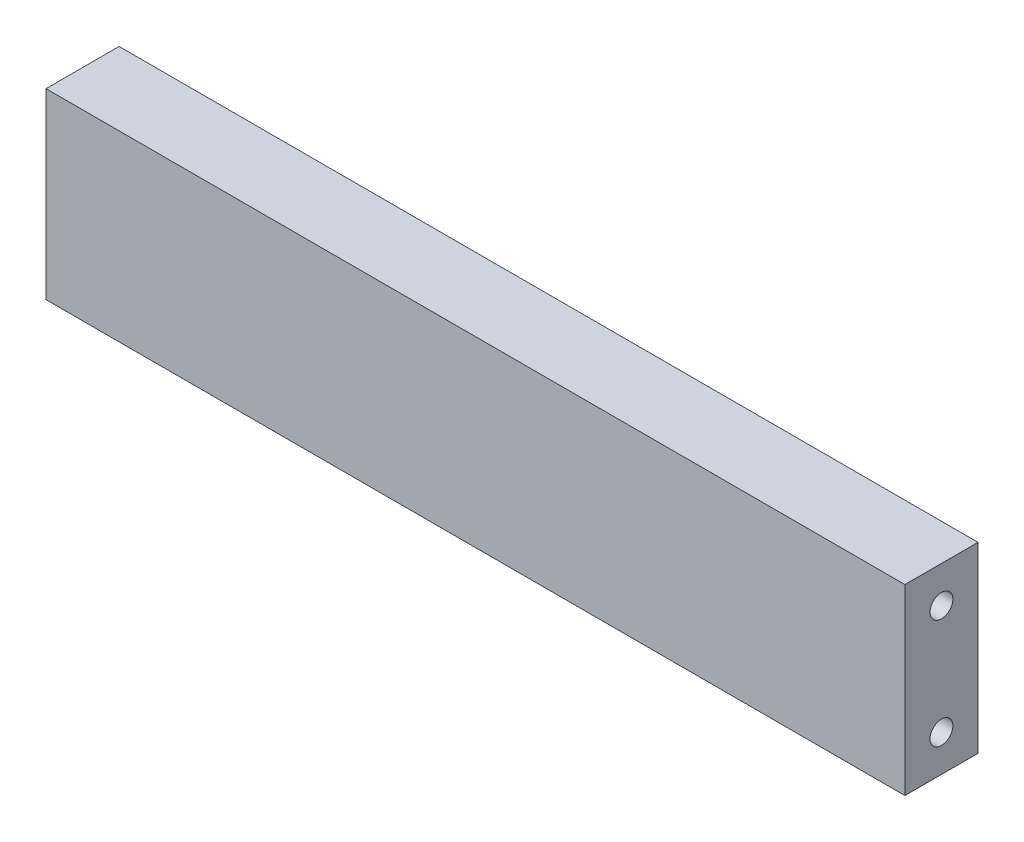
ISO-10303-21;
HEADER;
FILE_DESCRIPTION(('STEP AP214'),'2;1');
FILE_NAME('part.step','',(''),(''),'','','');
FILE_SCHEMA(('AUTOMOTIVE_DESIGN { 1 0 10303 214 1 1 1 1 }'));
ENDSEC;
DATA;
#1=APPLICATION_CONTEXT('core data for automotive mechanical design processes');
#2=APPLICATION_PROTOCOL_DEFINITION('international standard','automotive_design',2000,#1);
#3=PRODUCT_CONTEXT('',#1,'mechanical');
#4=PRODUCT('Part','Part','',(#3));
#5=PRODUCT_RELATED_PRODUCT_CATEGORY('part','',(#4));
#6=PRODUCT_DEFINITION_FORMATION('','',#4);
#7=PRODUCT_DEFINITION_CONTEXT('part definition',#1,'design');
#8=PRODUCT_DEFINITION('design','',#6,#7);
#9=PRODUCT_DEFINITION_SHAPE('','',#8);
#10=(LENGTH_UNIT() NAMED_UNIT(*) SI_UNIT(.MILLI.,.METRE.));
#11=(NAMED_UNIT(*) PLANE_ANGLE_UNIT() SI_UNIT($,.RADIAN.));
#12=(NAMED_UNIT(*) SI_UNIT($,.STERADIAN.) SOLID_ANGLE_UNIT());
#13=UNCERTAINTY_MEASURE_WITH_UNIT(LENGTH_MEASURE(1.E-05),#10,'distance_accuracy_value','');
#14=(GEOMETRIC_REPRESENTATION_CONTEXT(3) GLOBAL_UNCERTAINTY_ASSIGNED_CONTEXT((#13)) GLOBAL_UNIT_ASSIGNED_CONTEXT((#10,
#11,#12)) REPRESENTATION_CONTEXT('',''));
#15=CARTESIAN_POINT('',(0.,0.,0.));
#16=DIRECTION('',(0.,0.,1.));
#17=DIRECTION('',(1.,0.,0.));
#18=AXIS2_PLACEMENT_3D('',#15,#16,#17);
#19=CARTESIAN_POINT('',(47.,10.,8.));
#20=DIRECTION('',(-1.,0.,0.));
#21=DIRECTION('',(0.,0.,1.));
#22=AXIS2_PLACEMENT_3D('',#19,#20,#21);
#23=PLANE('',#22);
#24=CARTESIAN_POINT('',(47.,6.,4.));
#25=DIRECTION('',(1.,0.,0.));
#26=DIRECTION('',(0.,0.,-1.));
#27=AXIS2_PLACEMENT_3D('',#24,#25,#26);
#28=CIRCLE('',#27,1.24999999999999);
#29=CARTESIAN_POINT('',(47.,6.,2.75000000000001));
#30=VERTEX_POINT('',#29);
#31=EDGE_CURVE('E119',#30,#30,#28,.T.);
#32=ORIENTED_EDGE('',*,*,#31,.F.);
#33=EDGE_LOOP('',(#32));
#34=FACE_BOUND('',#33,.T.);
#35=CARTESIAN_POINT('',(47.,-6.,4.));
#36=DIRECTION('',(1.,0.,0.));
#37=DIRECTION('',(0.,0.,-1.));
#38=AXIS2_PLACEMENT_3D('',#35,#36,#37);
#39=CIRCLE('',#38,1.24999999999999);
#40=CARTESIAN_POINT('',(47.,-6.,2.75000000000001));
#41=VERTEX_POINT('',#40);
#42=EDGE_CURVE('E125',#41,#41,#39,.T.);
#43=ORIENTED_EDGE('',*,*,#42,.F.);
#44=EDGE_LOOP('',(#43));
#45=FACE_BOUND('',#44,.T.);
#46=DIRECTION('',(0.,1.,0.));
#47=VECTOR('',#46,1.);
#48=CARTESIAN_POINT('',(47.,10.,0.));
#49=LINE('',#48,#47);
#50=CARTESIAN_POINT('',(47.,-10.,0.));
#51=VERTEX_POINT('',#50);
#52=CARTESIAN_POINT('',(47.,10.,0.));
#53=VERTEX_POINT('',#52);
#54=EDGE_CURVE('E131',#51,#53,#49,.T.);
#55=ORIENTED_EDGE('',*,*,#54,.T.);
#56=DIRECTION('',(0.,0.,-1.));
#57=VECTOR('',#56,1.);
#58=CARTESIAN_POINT('',(47.,10.,8.));
#59=LINE('',#58,#57);
#60=CARTESIAN_POINT('',(47.,10.,8.));
#61=VERTEX_POINT('',#60);
#62=EDGE_CURVE('E11',#61,#53,#59,.T.);
#63=ORIENTED_EDGE('',*,*,#62,.F.);
#64=DIRECTION('',(0.,1.,0.));
#65=VECTOR('',#64,1.);
#66=CARTESIAN_POINT('',(47.,10.,8.));
#67=LINE('',#66,#65);
#68=CARTESIAN_POINT('',(47.,-10.,8.));
#69=VERTEX_POINT('',#68);
#70=EDGE_CURVE('E132',#69,#61,#67,.T.);
#71=ORIENTED_EDGE('',*,*,#70,.F.);
#72=DIRECTION('',(0.,0.,-1.));
#73=VECTOR('',#72,1.);
#74=CARTESIAN_POINT('',(47.,-10.,8.));
#75=LINE('',#74,#73);
#76=EDGE_CURVE('E138',#69,#51,#75,.T.);
#77=ORIENTED_EDGE('',*,*,#76,.T.);
#78=EDGE_LOOP('',(#55,#63,#71,#77));
#79=FACE_BOUND('',#78,.T.);
#80=ADVANCED_FACE('F38',(#34,#45,#79),#23,.F.);
#81=CARTESIAN_POINT('',(-47.,10.,8.));
#82=DIRECTION('',(0.,-1.,0.));
#83=DIRECTION('',(0.,0.,-1.));
#84=AXIS2_PLACEMENT_3D('',#81,#82,#83);
#85=PLANE('',#84);
#86=DIRECTION('',(-1.,0.,0.));
#87=VECTOR('',#86,1.);
#88=CARTESIAN_POINT('',(-47.,10.,0.));
#89=LINE('',#88,#87);
#90=CARTESIAN_POINT('',(-47.,10.,0.));
#91=VERTEX_POINT('',#90);
#92=EDGE_CURVE('E141',#53,#91,#89,.T.);
#93=ORIENTED_EDGE('',*,*,#92,.T.);
#94=DIRECTION('',(0.,0.,-1.));
#95=VECTOR('',#94,1.);
#96=CARTESIAN_POINT('',(-47.,10.,8.));
#97=LINE('',#96,#95);
#98=CARTESIAN_POINT('',(-47.,10.,8.));
#99=VERTEX_POINT('',#98);
#100=EDGE_CURVE('E46',#99,#91,#97,.T.);
#101=ORIENTED_EDGE('',*,*,#100,.F.);
#102=DIRECTION('',(-1.,0.,0.));
#103=VECTOR('',#102,1.);
#104=CARTESIAN_POINT('',(-47.,10.,8.));
#105=LINE('',#104,#103);
#106=EDGE_CURVE('E85',#61,#99,#105,.T.);
#107=ORIENTED_EDGE('',*,*,#106,.F.);
#108=ORIENTED_EDGE('',*,*,#62,.T.);
#109=EDGE_LOOP('',(#93,#101,#107,#108));
#110=FACE_BOUND('',#109,.T.);
#111=ADVANCED_FACE('F164',(#110),#85,.F.);
#112=CARTESIAN_POINT('',(-47.,10.,8.));
#113=DIRECTION('',(1.,0.,0.));
#114=DIRECTION('',(0.,1.,0.));
#115=AXIS2_PLACEMENT_3D('',#112,#113,#114);
#116=PLANE('',#115);
#117=CARTESIAN_POINT('',(-47.,5.99999999999999,4.));
#118=DIRECTION('',(-1.,0.,0.));
#119=DIRECTION('',(0.,0.,1.));
#120=AXIS2_PLACEMENT_3D('',#117,#118,#119);
#121=CIRCLE('',#120,1.24999999999999);
#122=CARTESIAN_POINT('',(-47.,5.99999999999999,5.24999999999999));
#123=VERTEX_POINT('',#122);
#124=EDGE_CURVE('E109',#123,#123,#121,.T.);
#125=ORIENTED_EDGE('',*,*,#124,.F.);
#126=EDGE_LOOP('',(#125));
#127=FACE_BOUND('',#126,.T.);
#128=CARTESIAN_POINT('',(-47.,-6.00000000000002,4.));
#129=DIRECTION('',(-1.,0.,0.));
#130=DIRECTION('',(0.,0.,1.));
#131=AXIS2_PLACEMENT_3D('',#128,#129,#130);
#132=CIRCLE('',#131,1.24999999999999);
#133=CARTESIAN_POINT('',(-47.,-6.00000000000002,5.24999999999999));
#134=VERTEX_POINT('',#133);
#135=EDGE_CURVE('E108',#134,#134,#132,.T.);
#136=ORIENTED_EDGE('',*,*,#135,.F.);
#137=EDGE_LOOP('',(#136));
#138=FACE_BOUND('',#137,.T.);
#139=DIRECTION('',(0.,-1.,0.));
#140=VECTOR('',#139,1.);
#141=CARTESIAN_POINT('',(-47.,10.,0.));
#142=LINE('',#141,#140);
#143=CARTESIAN_POINT('',(-47.,-10.,0.));
#144=VERTEX_POINT('',#143);
#145=EDGE_CURVE('E72',#91,#144,#142,.T.);
#146=ORIENTED_EDGE('',*,*,#145,.T.);
#147=DIRECTION('',(0.,0.,-1.));
#148=VECTOR('',#147,1.);
#149=CARTESIAN_POINT('',(-47.,-10.,8.));
#150=LINE('',#149,#148);
#151=CARTESIAN_POINT('',(-47.,-10.,8.));
#152=VERTEX_POINT('',#151);
#153=EDGE_CURVE('E146',#152,#144,#150,.T.);
#154=ORIENTED_EDGE('',*,*,#153,.F.);
#155=DIRECTION('',(0.,-1.,0.));
#156=VECTOR('',#155,1.);
#157=CARTESIAN_POINT('',(-47.,10.,8.));
#158=LINE('',#157,#156);
#159=EDGE_CURVE('E135',#99,#152,#158,.T.);
#160=ORIENTED_EDGE('',*,*,#159,.F.);
#161=ORIENTED_EDGE('',*,*,#100,.T.);
#162=EDGE_LOOP('',(#146,#154,#160,#161));
#163=FACE_BOUND('',#162,.T.);
#164=ADVANCED_FACE('F148',(#127,#138,#163),#116,.F.);
#165=CARTESIAN_POINT('',(-47.,-10.,8.));
#166=DIRECTION('',(0.,1.,0.));
#167=DIRECTION('',(0.,0.,1.));
#168=AXIS2_PLACEMENT_3D('',#165,#166,#167);
#169=PLANE('',#168);
#170=DIRECTION('',(1.,0.,0.));
#171=VECTOR('',#170,1.);
#172=CARTESIAN_POINT('',(-47.,-10.,0.));
#173=LINE('',#172,#171);
#174=EDGE_CURVE('E78',#144,#51,#173,.T.);
#175=ORIENTED_EDGE('',*,*,#174,.T.);
#176=ORIENTED_EDGE('',*,*,#76,.F.);
#177=DIRECTION('',(1.,0.,0.));
#178=VECTOR('',#177,1.);
#179=CARTESIAN_POINT('',(-47.,-10.,8.));
#180=LINE('',#179,#178);
#181=EDGE_CURVE('E54',#152,#69,#180,.T.);
#182=ORIENTED_EDGE('',*,*,#181,.F.);
#183=ORIENTED_EDGE('',*,*,#153,.T.);
#184=EDGE_LOOP('',(#175,#176,#182,#183));
#185=FACE_BOUND('',#184,.T.);
#186=ADVANCED_FACE('F155',(#185),#169,.F.);
#187=CARTESIAN_POINT('',(0.,0.,8.));
#188=DIRECTION('',(0.,0.,1.));
#189=DIRECTION('',(1.,0.,0.));
#190=AXIS2_PLACEMENT_3D('',#187,#188,#189);
#191=PLANE('',#190);
#192=ORIENTED_EDGE('',*,*,#70,.T.);
#193=ORIENTED_EDGE('',*,*,#106,.T.);
#194=ORIENTED_EDGE('',*,*,#159,.T.);
#195=ORIENTED_EDGE('',*,*,#181,.T.);
#196=EDGE_LOOP('',(#192,#193,#194,#195));
#197=FACE_BOUND('',#196,.T.);
#198=ADVANCED_FACE('F157',(#197),#191,.T.);
#199=CARTESIAN_POINT('',(0.,0.,0.));
#200=DIRECTION('',(0.,0.,1.));
#201=DIRECTION('',(1.,0.,0.));
#202=AXIS2_PLACEMENT_3D('',#199,#200,#201);
#203=PLANE('',#202);
#204=ORIENTED_EDGE('',*,*,#54,.F.);
#205=ORIENTED_EDGE('',*,*,#174,.F.);
#206=ORIENTED_EDGE('',*,*,#145,.F.);
#207=ORIENTED_EDGE('',*,*,#92,.F.);
#208=EDGE_LOOP('',(#204,#205,#206,#207));
#209=FACE_BOUND('',#208,.T.);
#210=ADVANCED_FACE('F151',(#209),#203,.F.);
#211=CARTESIAN_POINT('',(38.5,-6.,4.));
#212=DIRECTION('',(1.,0.,0.));
#213=DIRECTION('',(0.,0.,-1.));
#214=AXIS2_PLACEMENT_3D('',#211,#212,#213);
#215=CONICAL_SURFACE('',#214,1.25,1.02974425867665);
#216=CARTESIAN_POINT('',(37.7489242262156,-6.,4.));
#217=VERTEX_POINT('',#216);
#218=VERTEX_LOOP('',#217);
#219=FACE_BOUND('',#218,.T.);
#220=CARTESIAN_POINT('',(38.5,-6.,4.));
#221=DIRECTION('',(1.,0.,0.));
#222=DIRECTION('',(0.,0.,-1.));
#223=AXIS2_PLACEMENT_3D('',#220,#221,#222);
#224=CIRCLE('',#223,1.25);
#225=CARTESIAN_POINT('',(38.5,-6.,2.75));
#226=VERTEX_POINT('',#225);
#227=EDGE_CURVE('E128',#226,#226,#224,.T.);
#228=ORIENTED_EDGE('',*,*,#227,.T.);
#229=EDGE_LOOP('',(#228));
#230=FACE_BOUND('',#229,.T.);
#231=ADVANCED_FACE('F180',(#219,#230),#215,.F.);
#232=CARTESIAN_POINT('',(47.,-6.,4.));
#233=DIRECTION('',(1.,0.,0.));
#234=DIRECTION('',(0.,0.,-1.));
#235=AXIS2_PLACEMENT_3D('',#232,#233,#234);
#236=CYLINDRICAL_SURFACE('',#235,1.24999999999999);
#237=ORIENTED_EDGE('',*,*,#227,.F.);
#238=EDGE_LOOP('',(#237));
#239=FACE_BOUND('',#238,.T.);
#240=ORIENTED_EDGE('',*,*,#42,.T.);
#241=EDGE_LOOP('',(#240));
#242=FACE_BOUND('',#241,.T.);
#243=ADVANCED_FACE('F177',(#239,#242),#236,.F.);
#244=CARTESIAN_POINT('',(38.5,6.,4.));
#245=DIRECTION('',(1.,0.,0.));
#246=DIRECTION('',(0.,0.,-1.));
#247=AXIS2_PLACEMENT_3D('',#244,#245,#246);
#248=CONICAL_SURFACE('',#247,1.25,1.02974425867665);
#249=CARTESIAN_POINT('',(37.7489242262156,6.,4.));
#250=VERTEX_POINT('',#249);
#251=VERTEX_LOOP('',#250);
#252=FACE_BOUND('',#251,.T.);
#253=CARTESIAN_POINT('',(38.5,6.,4.));
#254=DIRECTION('',(1.,0.,0.));
#255=DIRECTION('',(0.,0.,-1.));
#256=AXIS2_PLACEMENT_3D('',#253,#254,#255);
#257=CIRCLE('',#256,1.25);
#258=CARTESIAN_POINT('',(38.5,6.,2.75));
#259=VERTEX_POINT('',#258);
#260=EDGE_CURVE('E122',#259,#259,#257,.T.);
#261=ORIENTED_EDGE('',*,*,#260,.T.);
#262=EDGE_LOOP('',(#261));
#263=FACE_BOUND('',#262,.T.);
#264=ADVANCED_FACE('F179',(#252,#263),#248,.F.);
#265=CARTESIAN_POINT('',(47.,6.,4.));
#266=DIRECTION('',(1.,0.,0.));
#267=DIRECTION('',(0.,0.,-1.));
#268=AXIS2_PLACEMENT_3D('',#265,#266,#267);
#269=CYLINDRICAL_SURFACE('',#268,1.24999999999999);
#270=ORIENTED_EDGE('',*,*,#260,.F.);
#271=EDGE_LOOP('',(#270));
#272=FACE_BOUND('',#271,.T.);
#273=ORIENTED_EDGE('',*,*,#31,.T.);
#274=EDGE_LOOP('',(#273));
#275=FACE_BOUND('',#274,.T.);
#276=ADVANCED_FACE('F187',(#272,#275),#269,.F.);
#277=CARTESIAN_POINT('',(-38.5,-6.00000000000002,4.));
#278=DIRECTION('',(-1.,0.,0.));
#279=DIRECTION('',(0.,0.,1.));
#280=AXIS2_PLACEMENT_3D('',#277,#278,#279);
#281=CONICAL_SURFACE('',#280,1.25,1.02974425867665);
#282=CARTESIAN_POINT('',(-37.7489242262156,-6.00000000000002,4.));
#283=VERTEX_POINT('',#282);
#284=VERTEX_LOOP('',#283);
#285=FACE_BOUND('',#284,.T.);
#286=CARTESIAN_POINT('',(-38.5,-6.00000000000002,4.));
#287=DIRECTION('',(-1.,0.,0.));
#288=DIRECTION('',(0.,0.,1.));
#289=AXIS2_PLACEMENT_3D('',#286,#287,#288);
#290=CIRCLE('',#289,1.25);
#291=CARTESIAN_POINT('',(-38.5,-6.00000000000002,5.25));
#292=VERTEX_POINT('',#291);
#293=EDGE_CURVE('E112',#292,#292,#290,.T.);
#294=ORIENTED_EDGE('',*,*,#293,.T.);
#295=EDGE_LOOP('',(#294));
#296=FACE_BOUND('',#295,.T.);
#297=ADVANCED_FACE('F231',(#285,#296),#281,.F.);
#298=CARTESIAN_POINT('',(-47.,-6.00000000000002,4.));
#299=DIRECTION('',(-1.,0.,0.));
#300=DIRECTION('',(0.,0.,1.));
#301=AXIS2_PLACEMENT_3D('',#298,#299,#300);
#302=CYLINDRICAL_SURFACE('',#301,1.24999999999999);
#303=ORIENTED_EDGE('',*,*,#293,.F.);
#304=EDGE_LOOP('',(#303));
#305=FACE_BOUND('',#304,.T.);
#306=ORIENTED_EDGE('',*,*,#135,.T.);
#307=EDGE_LOOP('',(#306));
#308=FACE_BOUND('',#307,.T.);
#309=ADVANCED_FACE('F102',(#305,#308),#302,.F.);
#310=CARTESIAN_POINT('',(-38.5,5.99999999999999,4.));
#311=DIRECTION('',(-1.,0.,0.));
#312=DIRECTION('',(0.,0.,1.));
#313=AXIS2_PLACEMENT_3D('',#310,#311,#312);
#314=CONICAL_SURFACE('',#313,1.25,1.02974425867665);
#315=CARTESIAN_POINT('',(-37.7489242262156,5.99999999999998,4.));
#316=VERTEX_POINT('',#315);
#317=VERTEX_LOOP('',#316);
#318=FACE_BOUND('',#317,.T.);
#319=CARTESIAN_POINT('',(-38.5,5.99999999999999,4.));
#320=DIRECTION('',(-1.,0.,0.));
#321=DIRECTION('',(0.,0.,1.));
#322=AXIS2_PLACEMENT_3D('',#319,#320,#321);
#323=CIRCLE('',#322,1.25);
#324=CARTESIAN_POINT('',(-38.5,5.99999999999999,5.25));
#325=VERTEX_POINT('',#324);
#326=EDGE_CURVE('E106',#325,#325,#323,.T.);
#327=ORIENTED_EDGE('',*,*,#326,.T.);
#328=EDGE_LOOP('',(#327));
#329=FACE_BOUND('',#328,.T.);
#330=ADVANCED_FACE('F98',(#318,#329),#314,.F.);
#331=CARTESIAN_POINT('',(-47.,5.99999999999999,4.));
#332=DIRECTION('',(-1.,0.,0.));
#333=DIRECTION('',(0.,0.,1.));
#334=AXIS2_PLACEMENT_3D('',#331,#332,#333);
#335=CYLINDRICAL_SURFACE('',#334,1.24999999999999);
#336=ORIENTED_EDGE('',*,*,#326,.F.);
#337=EDGE_LOOP('',(#336));
#338=FACE_BOUND('',#337,.T.);
#339=ORIENTED_EDGE('',*,*,#124,.T.);
#340=EDGE_LOOP('',(#339));
#341=FACE_BOUND('',#340,.T.);
#342=ADVANCED_FACE('F101',(#338,#341),#335,.F.);
#343=CLOSED_SHELL('',(#80,#111,#164,#186,#198,#210,#231,#243,#264,#276,#297,#309,#330,#342));
#344=MANIFOLD_SOLID_BREP('B2',#343);
#345=ADVANCED_BREP_SHAPE_REPRESENTATION('',(#18,#344),#14);
#346=SHAPE_DEFINITION_REPRESENTATION(#9,#345);
ENDSEC;
END-ISO-10303-21;
